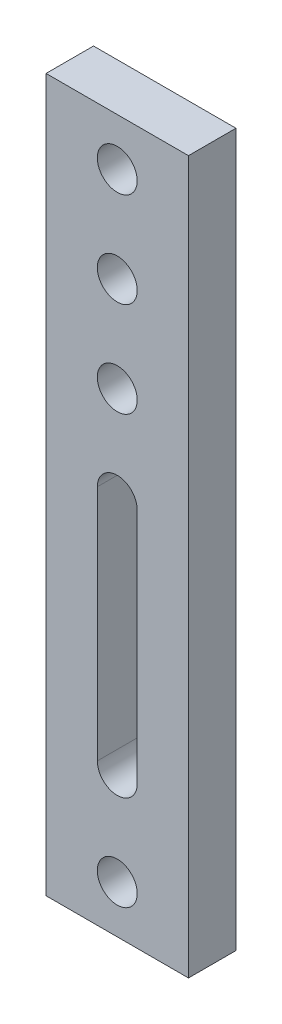
ISO-10303-21;
HEADER;
FILE_DESCRIPTION(('STEP AP214'),'2;1');
FILE_NAME('part.step','',(''),(''),'','','');
FILE_SCHEMA(('AUTOMOTIVE_DESIGN { 1 0 10303 214 1 1 1 1 }'));
ENDSEC;
DATA;
#1=APPLICATION_CONTEXT('core data for automotive mechanical design processes');
#2=APPLICATION_PROTOCOL_DEFINITION('international standard','automotive_design',2000,#1);
#3=PRODUCT_CONTEXT('',#1,'mechanical');
#4=PRODUCT('Part','Part','',(#3));
#5=PRODUCT_RELATED_PRODUCT_CATEGORY('part','',(#4));
#6=PRODUCT_DEFINITION_FORMATION('','',#4);
#7=PRODUCT_DEFINITION_CONTEXT('part definition',#1,'design');
#8=PRODUCT_DEFINITION('design','',#6,#7);
#9=PRODUCT_DEFINITION_SHAPE('','',#8);
#10=(LENGTH_UNIT() NAMED_UNIT(*) SI_UNIT(.MILLI.,.METRE.));
#11=(NAMED_UNIT(*) PLANE_ANGLE_UNIT() SI_UNIT($,.RADIAN.));
#12=(NAMED_UNIT(*) SI_UNIT($,.STERADIAN.) SOLID_ANGLE_UNIT());
#13=UNCERTAINTY_MEASURE_WITH_UNIT(LENGTH_MEASURE(1.E-05),#10,'distance_accuracy_value','');
#14=(GEOMETRIC_REPRESENTATION_CONTEXT(3) GLOBAL_UNCERTAINTY_ASSIGNED_CONTEXT((#13)) GLOBAL_UNIT_ASSIGNED_CONTEXT((#10,
#11,#12)) REPRESENTATION_CONTEXT('',''));
#15=CARTESIAN_POINT('',(0.,0.,0.));
#16=DIRECTION('',(0.,0.,1.));
#17=DIRECTION('',(1.,0.,0.));
#18=AXIS2_PLACEMENT_3D('',#15,#16,#17);
#19=CARTESIAN_POINT('',(0.,0.,25.));
#20=DIRECTION('',(1.,0.,0.));
#21=DIRECTION('',(0.,0.,-1.));
#22=AXIS2_PLACEMENT_3D('',#19,#20,#21);
#23=PLANE('',#22);
#24=DIRECTION('',(0.,-1.,0.));
#25=VECTOR('',#24,1.);
#26=CARTESIAN_POINT('',(0.,0.,0.));
#27=LINE('',#26,#25);
#28=CARTESIAN_POINT('',(0.,375.,0.));
#29=VERTEX_POINT('',#28);
#30=CARTESIAN_POINT('',(0.,0.,0.));
#31=VERTEX_POINT('',#30);
#32=EDGE_CURVE('E135',#29,#31,#27,.T.);
#33=ORIENTED_EDGE('',*,*,#32,.T.);
#34=DIRECTION('',(0.,0.,-1.));
#35=VECTOR('',#34,1.);
#36=CARTESIAN_POINT('',(0.,0.,25.));
#37=LINE('',#36,#35);
#38=CARTESIAN_POINT('',(0.,0.,25.));
#39=VERTEX_POINT('',#38);
#40=EDGE_CURVE('E11',#39,#31,#37,.T.);
#41=ORIENTED_EDGE('',*,*,#40,.F.);
#42=DIRECTION('',(0.,-1.,0.));
#43=VECTOR('',#42,1.);
#44=CARTESIAN_POINT('',(0.,0.,25.));
#45=LINE('',#44,#43);
#46=CARTESIAN_POINT('',(0.,375.,25.));
#47=VERTEX_POINT('',#46);
#48=EDGE_CURVE('E139',#47,#39,#45,.T.);
#49=ORIENTED_EDGE('',*,*,#48,.F.);
#50=DIRECTION('',(0.,0.,-1.));
#51=VECTOR('',#50,1.);
#52=CARTESIAN_POINT('',(0.,375.,25.));
#53=LINE('',#52,#51);
#54=EDGE_CURVE('E149',#47,#29,#53,.T.);
#55=ORIENTED_EDGE('',*,*,#54,.T.);
#56=EDGE_LOOP('',(#33,#41,#49,#55));
#57=FACE_BOUND('',#56,.T.);
#58=ADVANCED_FACE('F34',(#57),#23,.F.);
#59=CARTESIAN_POINT('',(0.,0.,25.));
#60=DIRECTION('',(0.,1.,0.));
#61=DIRECTION('',(0.,0.,1.));
#62=AXIS2_PLACEMENT_3D('',#59,#60,#61);
#63=PLANE('',#62);
#64=DIRECTION('',(1.,0.,0.));
#65=VECTOR('',#64,1.);
#66=CARTESIAN_POINT('',(0.,0.,0.));
#67=LINE('',#66,#65);
#68=CARTESIAN_POINT('',(75.,0.,0.));
#69=VERTEX_POINT('',#68);
#70=EDGE_CURVE('E152',#31,#69,#67,.T.);
#71=ORIENTED_EDGE('',*,*,#70,.T.);
#72=DIRECTION('',(0.,0.,-1.));
#73=VECTOR('',#72,1.);
#74=CARTESIAN_POINT('',(75.,0.,25.));
#75=LINE('',#74,#73);
#76=CARTESIAN_POINT('',(75.,0.,25.));
#77=VERTEX_POINT('',#76);
#78=EDGE_CURVE('E41',#77,#69,#75,.T.);
#79=ORIENTED_EDGE('',*,*,#78,.F.);
#80=DIRECTION('',(1.,0.,0.));
#81=VECTOR('',#80,1.);
#82=CARTESIAN_POINT('',(0.,0.,25.));
#83=LINE('',#82,#81);
#84=EDGE_CURVE('E142',#39,#77,#83,.T.);
#85=ORIENTED_EDGE('',*,*,#84,.F.);
#86=ORIENTED_EDGE('',*,*,#40,.T.);
#87=EDGE_LOOP('',(#71,#79,#85,#86));
#88=FACE_BOUND('',#87,.T.);
#89=ADVANCED_FACE('F180',(#88),#63,.F.);
#90=CARTESIAN_POINT('',(75.,0.,25.));
#91=DIRECTION('',(-1.,0.,0.));
#92=DIRECTION('',(0.,0.,1.));
#93=AXIS2_PLACEMENT_3D('',#90,#91,#92);
#94=PLANE('',#93);
#95=DIRECTION('',(0.,1.,0.));
#96=VECTOR('',#95,1.);
#97=CARTESIAN_POINT('',(75.,0.,0.));
#98=LINE('',#97,#96);
#99=CARTESIAN_POINT('',(75.,375.,0.));
#100=VERTEX_POINT('',#99);
#101=EDGE_CURVE('E154',#69,#100,#98,.T.);
#102=ORIENTED_EDGE('',*,*,#101,.T.);
#103=DIRECTION('',(0.,0.,-1.));
#104=VECTOR('',#103,1.);
#105=CARTESIAN_POINT('',(75.,375.,25.));
#106=LINE('',#105,#104);
#107=CARTESIAN_POINT('',(75.,375.,25.));
#108=VERTEX_POINT('',#107);
#109=EDGE_CURVE('E159',#108,#100,#106,.T.);
#110=ORIENTED_EDGE('',*,*,#109,.F.);
#111=DIRECTION('',(0.,1.,0.));
#112=VECTOR('',#111,1.);
#113=CARTESIAN_POINT('',(75.,0.,25.));
#114=LINE('',#113,#112);
#115=EDGE_CURVE('E145',#77,#108,#114,.T.);
#116=ORIENTED_EDGE('',*,*,#115,.F.);
#117=ORIENTED_EDGE('',*,*,#78,.T.);
#118=EDGE_LOOP('',(#102,#110,#116,#117));
#119=FACE_BOUND('',#118,.T.);
#120=ADVANCED_FACE('F166',(#119),#94,.F.);
#121=CARTESIAN_POINT('',(0.,375.,25.));
#122=DIRECTION('',(0.,-1.,0.));
#123=DIRECTION('',(0.,0.,-1.));
#124=AXIS2_PLACEMENT_3D('',#121,#122,#123);
#125=PLANE('',#124);
#126=DIRECTION('',(-1.,0.,0.));
#127=VECTOR('',#126,1.);
#128=CARTESIAN_POINT('',(0.,375.,0.));
#129=LINE('',#128,#127);
#130=EDGE_CURVE('E143',#100,#29,#129,.T.);
#131=ORIENTED_EDGE('',*,*,#130,.T.);
#132=ORIENTED_EDGE('',*,*,#54,.F.);
#133=DIRECTION('',(-1.,0.,0.));
#134=VECTOR('',#133,1.);
#135=CARTESIAN_POINT('',(0.,375.,25.));
#136=LINE('',#135,#134);
#137=EDGE_CURVE('E147',#108,#47,#136,.T.);
#138=ORIENTED_EDGE('',*,*,#137,.F.);
#139=ORIENTED_EDGE('',*,*,#109,.T.);
#140=EDGE_LOOP('',(#131,#132,#138,#139));
#141=FACE_BOUND('',#140,.T.);
#142=ADVANCED_FACE('F173',(#141),#125,.F.);
#143=CARTESIAN_POINT('',(0.,0.,25.));
#144=DIRECTION('',(0.,0.,-1.));
#145=DIRECTION('',(-1.,0.,0.));
#146=AXIS2_PLACEMENT_3D('',#143,#144,#145);
#147=PLANE('',#146);
#148=CARTESIAN_POINT('',(37.5,25.,25.));
#149=DIRECTION('',(0.,0.,1.));
#150=DIRECTION('',(1.,0.,0.));
#151=AXIS2_PLACEMENT_3D('',#148,#149,#150);
#152=CIRCLE('',#151,10.5);
#153=CARTESIAN_POINT('',(48.,25.,25.));
#154=VERTEX_POINT('',#153);
#155=EDGE_CURVE('E236',#154,#154,#152,.T.);
#156=ORIENTED_EDGE('',*,*,#155,.F.);
#157=EDGE_LOOP('',(#156));
#158=FACE_BOUND('',#157,.T.);
#159=CARTESIAN_POINT('',(37.4999999999997,350.,25.));
#160=DIRECTION('',(0.,0.,1.));
#161=DIRECTION('',(1.,0.,0.));
#162=AXIS2_PLACEMENT_3D('',#159,#160,#161);
#163=CIRCLE('',#162,10.5);
#164=CARTESIAN_POINT('',(47.9999999999997,350.,25.));
#165=VERTEX_POINT('',#164);
#166=EDGE_CURVE('E230',#165,#165,#163,.T.);
#167=ORIENTED_EDGE('',*,*,#166,.F.);
#168=EDGE_LOOP('',(#167));
#169=FACE_BOUND('',#168,.T.);
#170=CARTESIAN_POINT('',(37.4999999999998,300.,25.));
#171=DIRECTION('',(0.,0.,1.));
#172=DIRECTION('',(1.,0.,0.));
#173=AXIS2_PLACEMENT_3D('',#170,#171,#172);
#174=CIRCLE('',#173,10.5);
#175=CARTESIAN_POINT('',(47.9999999999998,300.,25.));
#176=VERTEX_POINT('',#175);
#177=EDGE_CURVE('E122',#176,#176,#174,.T.);
#178=ORIENTED_EDGE('',*,*,#177,.F.);
#179=EDGE_LOOP('',(#178));
#180=FACE_BOUND('',#179,.T.);
#181=CARTESIAN_POINT('',(37.5,250.,25.));
#182=DIRECTION('',(0.,0.,1.));
#183=DIRECTION('',(1.,0.,0.));
#184=AXIS2_PLACEMENT_3D('',#181,#182,#183);
#185=CIRCLE('',#184,10.5);
#186=CARTESIAN_POINT('',(48.,250.,25.));
#187=VERTEX_POINT('',#186);
#188=EDGE_CURVE('E243',#187,#187,#185,.T.);
#189=ORIENTED_EDGE('',*,*,#188,.F.);
#190=EDGE_LOOP('',(#189));
#191=FACE_BOUND('',#190,.T.);
#192=DIRECTION('',(0.,1.,0.));
#193=VECTOR('',#192,1.);
#194=CARTESIAN_POINT('',(48.,75.,25.));
#195=LINE('',#194,#193);
#196=CARTESIAN_POINT('',(48.,75.,25.));
#197=VERTEX_POINT('',#196);
#198=CARTESIAN_POINT('',(48.,200.,25.));
#199=VERTEX_POINT('',#198);
#200=EDGE_CURVE('E128',#197,#199,#195,.T.);
#201=ORIENTED_EDGE('',*,*,#200,.F.);
#202=CARTESIAN_POINT('',(37.5,75.,25.));
#203=DIRECTION('',(0.,0.,1.));
#204=DIRECTION('',(1.,0.,0.));
#205=AXIS2_PLACEMENT_3D('',#202,#203,#204);
#206=CIRCLE('',#205,10.5);
#207=CARTESIAN_POINT('',(27.,75.,25.));
#208=VERTEX_POINT('',#207);
#209=EDGE_CURVE('E48',#208,#197,#206,.T.);
#210=ORIENTED_EDGE('',*,*,#209,.F.);
#211=DIRECTION('',(0.,-1.,0.));
#212=VECTOR('',#211,1.);
#213=CARTESIAN_POINT('',(27.,75.,25.));
#214=LINE('',#213,#212);
#215=CARTESIAN_POINT('',(27.,200.,25.));
#216=VERTEX_POINT('',#215);
#217=EDGE_CURVE('E116',#216,#208,#214,.T.);
#218=ORIENTED_EDGE('',*,*,#217,.F.);
#219=CARTESIAN_POINT('',(37.5,200.,25.));
#220=DIRECTION('',(0.,0.,1.));
#221=DIRECTION('',(-1.,0.,0.));
#222=AXIS2_PLACEMENT_3D('',#219,#220,#221);
#223=CIRCLE('',#222,10.5);
#224=EDGE_CURVE('E119',#199,#216,#223,.T.);
#225=ORIENTED_EDGE('',*,*,#224,.F.);
#226=EDGE_LOOP('',(#201,#210,#218,#225));
#227=FACE_BOUND('',#226,.T.);
#228=ORIENTED_EDGE('',*,*,#48,.T.);
#229=ORIENTED_EDGE('',*,*,#84,.T.);
#230=ORIENTED_EDGE('',*,*,#115,.T.);
#231=ORIENTED_EDGE('',*,*,#137,.T.);
#232=EDGE_LOOP('',(#228,#229,#230,#231));
#233=FACE_BOUND('',#232,.T.);
#234=ADVANCED_FACE('F179',(#158,#169,#180,#191,#227,#233),#147,.F.);
#235=CARTESIAN_POINT('',(0.,0.,0.));
#236=DIRECTION('',(0.,0.,-1.));
#237=DIRECTION('',(-1.,0.,0.));
#238=AXIS2_PLACEMENT_3D('',#235,#236,#237);
#239=PLANE('',#238);
#240=CARTESIAN_POINT('',(37.5,25.,0.));
#241=DIRECTION('',(0.,0.,1.));
#242=DIRECTION('',(1.,0.,0.));
#243=AXIS2_PLACEMENT_3D('',#240,#241,#242);
#244=CIRCLE('',#243,10.5);
#245=CARTESIAN_POINT('',(48.,25.,0.));
#246=VERTEX_POINT('',#245);
#247=EDGE_CURVE('E232',#246,#246,#244,.T.);
#248=ORIENTED_EDGE('',*,*,#247,.T.);
#249=EDGE_LOOP('',(#248));
#250=FACE_BOUND('',#249,.T.);
#251=CARTESIAN_POINT('',(37.4999999999997,350.,0.));
#252=DIRECTION('',(0.,0.,1.));
#253=DIRECTION('',(1.,0.,0.));
#254=AXIS2_PLACEMENT_3D('',#251,#252,#253);
#255=CIRCLE('',#254,10.5);
#256=CARTESIAN_POINT('',(47.9999999999997,350.,0.));
#257=VERTEX_POINT('',#256);
#258=EDGE_CURVE('E227',#257,#257,#255,.T.);
#259=ORIENTED_EDGE('',*,*,#258,.T.);
#260=EDGE_LOOP('',(#259));
#261=FACE_BOUND('',#260,.T.);
#262=CARTESIAN_POINT('',(37.4999999999998,300.,0.));
#263=DIRECTION('',(0.,0.,1.));
#264=DIRECTION('',(1.,0.,0.));
#265=AXIS2_PLACEMENT_3D('',#262,#263,#264);
#266=CIRCLE('',#265,10.5);
#267=CARTESIAN_POINT('',(47.9999999999998,300.,0.));
#268=VERTEX_POINT('',#267);
#269=EDGE_CURVE('E245',#268,#268,#266,.T.);
#270=ORIENTED_EDGE('',*,*,#269,.T.);
#271=EDGE_LOOP('',(#270));
#272=FACE_BOUND('',#271,.T.);
#273=CARTESIAN_POINT('',(37.5,250.,0.));
#274=DIRECTION('',(0.,0.,1.));
#275=DIRECTION('',(1.,0.,0.));
#276=AXIS2_PLACEMENT_3D('',#273,#274,#275);
#277=CIRCLE('',#276,10.5);
#278=CARTESIAN_POINT('',(48.,250.,0.));
#279=VERTEX_POINT('',#278);
#280=EDGE_CURVE('E129',#279,#279,#277,.T.);
#281=ORIENTED_EDGE('',*,*,#280,.T.);
#282=EDGE_LOOP('',(#281));
#283=FACE_BOUND('',#282,.T.);
#284=CARTESIAN_POINT('',(37.5,75.,0.));
#285=DIRECTION('',(0.,0.,1.));
#286=DIRECTION('',(1.,0.,0.));
#287=AXIS2_PLACEMENT_3D('',#284,#285,#286);
#288=CIRCLE('',#287,10.5);
#289=CARTESIAN_POINT('',(27.,75.,0.));
#290=VERTEX_POINT('',#289);
#291=CARTESIAN_POINT('',(48.,75.,0.));
#292=VERTEX_POINT('',#291);
#293=EDGE_CURVE('E100',#290,#292,#288,.T.);
#294=ORIENTED_EDGE('',*,*,#293,.T.);
#295=DIRECTION('',(0.,1.,0.));
#296=VECTOR('',#295,1.);
#297=CARTESIAN_POINT('',(48.,75.,0.));
#298=LINE('',#297,#296);
#299=CARTESIAN_POINT('',(48.,200.,0.));
#300=VERTEX_POINT('',#299);
#301=EDGE_CURVE('E109',#292,#300,#298,.T.);
#302=ORIENTED_EDGE('',*,*,#301,.T.);
#303=CARTESIAN_POINT('',(37.5,200.,0.));
#304=DIRECTION('',(0.,0.,1.));
#305=DIRECTION('',(-1.,0.,0.));
#306=AXIS2_PLACEMENT_3D('',#303,#304,#305);
#307=CIRCLE('',#306,10.5);
#308=CARTESIAN_POINT('',(27.,200.,0.));
#309=VERTEX_POINT('',#308);
#310=EDGE_CURVE('E56',#300,#309,#307,.T.);
#311=ORIENTED_EDGE('',*,*,#310,.T.);
#312=DIRECTION('',(0.,-1.,0.));
#313=VECTOR('',#312,1.);
#314=CARTESIAN_POINT('',(27.,75.,0.));
#315=LINE('',#314,#313);
#316=EDGE_CURVE('E106',#309,#290,#315,.T.);
#317=ORIENTED_EDGE('',*,*,#316,.T.);
#318=EDGE_LOOP('',(#294,#302,#311,#317));
#319=FACE_BOUND('',#318,.T.);
#320=ORIENTED_EDGE('',*,*,#32,.F.);
#321=ORIENTED_EDGE('',*,*,#130,.F.);
#322=ORIENTED_EDGE('',*,*,#101,.F.);
#323=ORIENTED_EDGE('',*,*,#70,.F.);
#324=EDGE_LOOP('',(#320,#321,#322,#323));
#325=FACE_BOUND('',#324,.T.);
#326=ADVANCED_FACE('F113',(#250,#261,#272,#283,#319,#325),#239,.T.);
#327=CARTESIAN_POINT('',(37.5,75.,0.));
#328=DIRECTION('',(0.,0.,1.));
#329=DIRECTION('',(1.,0.,0.));
#330=AXIS2_PLACEMENT_3D('',#327,#328,#329);
#331=CYLINDRICAL_SURFACE('',#330,10.5);
#332=ORIENTED_EDGE('',*,*,#209,.T.);
#333=DIRECTION('',(0.,0.,1.));
#334=VECTOR('',#333,1.);
#335=CARTESIAN_POINT('',(48.,75.,0.));
#336=LINE('',#335,#334);
#337=EDGE_CURVE('E96',#292,#197,#336,.T.);
#338=ORIENTED_EDGE('',*,*,#337,.F.);
#339=ORIENTED_EDGE('',*,*,#293,.F.);
#340=DIRECTION('',(0.,0.,1.));
#341=VECTOR('',#340,1.);
#342=CARTESIAN_POINT('',(27.,75.,0.));
#343=LINE('',#342,#341);
#344=EDGE_CURVE('E133',#290,#208,#343,.T.);
#345=ORIENTED_EDGE('',*,*,#344,.T.);
#346=EDGE_LOOP('',(#332,#338,#339,#345));
#347=FACE_BOUND('',#346,.T.);
#348=ADVANCED_FACE('F98',(#347),#331,.F.);
#349=CARTESIAN_POINT('',(27.,75.,0.));
#350=DIRECTION('',(-1.,0.,0.));
#351=DIRECTION('',(0.,0.,1.));
#352=AXIS2_PLACEMENT_3D('',#349,#350,#351);
#353=PLANE('',#352);
#354=ORIENTED_EDGE('',*,*,#217,.T.);
#355=ORIENTED_EDGE('',*,*,#344,.F.);
#356=ORIENTED_EDGE('',*,*,#316,.F.);
#357=DIRECTION('',(0.,0.,1.));
#358=VECTOR('',#357,1.);
#359=CARTESIAN_POINT('',(27.,200.,0.));
#360=LINE('',#359,#358);
#361=EDGE_CURVE('E136',#309,#216,#360,.T.);
#362=ORIENTED_EDGE('',*,*,#361,.T.);
#363=EDGE_LOOP('',(#354,#355,#356,#362));
#364=FACE_BOUND('',#363,.T.);
#365=ADVANCED_FACE('F198',(#364),#353,.F.);
#366=CARTESIAN_POINT('',(37.5,200.,0.));
#367=DIRECTION('',(0.,0.,1.));
#368=DIRECTION('',(1.,0.,0.));
#369=AXIS2_PLACEMENT_3D('',#366,#367,#368);
#370=CYLINDRICAL_SURFACE('',#369,10.5);
#371=ORIENTED_EDGE('',*,*,#224,.T.);
#372=ORIENTED_EDGE('',*,*,#361,.F.);
#373=ORIENTED_EDGE('',*,*,#310,.F.);
#374=DIRECTION('',(0.,0.,1.));
#375=VECTOR('',#374,1.);
#376=CARTESIAN_POINT('',(48.,200.,0.));
#377=LINE('',#376,#375);
#378=EDGE_CURVE('E105',#300,#199,#377,.T.);
#379=ORIENTED_EDGE('',*,*,#378,.T.);
#380=EDGE_LOOP('',(#371,#372,#373,#379));
#381=FACE_BOUND('',#380,.T.);
#382=ADVANCED_FACE('F202',(#381),#370,.F.);
#383=CARTESIAN_POINT('',(48.,75.,0.));
#384=DIRECTION('',(1.,0.,0.));
#385=DIRECTION('',(0.,0.,-1.));
#386=AXIS2_PLACEMENT_3D('',#383,#384,#385);
#387=PLANE('',#386);
#388=ORIENTED_EDGE('',*,*,#200,.T.);
#389=ORIENTED_EDGE('',*,*,#378,.F.);
#390=ORIENTED_EDGE('',*,*,#301,.F.);
#391=ORIENTED_EDGE('',*,*,#337,.T.);
#392=EDGE_LOOP('',(#388,#389,#390,#391));
#393=FACE_BOUND('',#392,.T.);
#394=ADVANCED_FACE('F110',(#393),#387,.F.);
#395=CARTESIAN_POINT('',(37.5,250.,0.));
#396=DIRECTION('',(0.,0.,1.));
#397=DIRECTION('',(1.,0.,0.));
#398=AXIS2_PLACEMENT_3D('',#395,#396,#397);
#399=CYLINDRICAL_SURFACE('',#398,10.5);
#400=ORIENTED_EDGE('',*,*,#280,.F.);
#401=EDGE_LOOP('',(#400));
#402=FACE_BOUND('',#401,.T.);
#403=ORIENTED_EDGE('',*,*,#188,.T.);
#404=EDGE_LOOP('',(#403));
#405=FACE_BOUND('',#404,.T.);
#406=ADVANCED_FACE('F201',(#402,#405),#399,.F.);
#407=CARTESIAN_POINT('',(37.4999999999998,300.,0.));
#408=DIRECTION('',(0.,0.,1.));
#409=DIRECTION('',(1.,0.,0.));
#410=AXIS2_PLACEMENT_3D('',#407,#408,#409);
#411=CYLINDRICAL_SURFACE('',#410,10.5);
#412=ORIENTED_EDGE('',*,*,#269,.F.);
#413=EDGE_LOOP('',(#412));
#414=FACE_BOUND('',#413,.T.);
#415=ORIENTED_EDGE('',*,*,#177,.T.);
#416=EDGE_LOOP('',(#415));
#417=FACE_BOUND('',#416,.T.);
#418=ADVANCED_FACE('F208',(#414,#417),#411,.F.);
#419=CARTESIAN_POINT('',(37.4999999999997,350.,0.));
#420=DIRECTION('',(0.,0.,1.));
#421=DIRECTION('',(1.,0.,0.));
#422=AXIS2_PLACEMENT_3D('',#419,#420,#421);
#423=CYLINDRICAL_SURFACE('',#422,10.5);
#424=ORIENTED_EDGE('',*,*,#258,.F.);
#425=EDGE_LOOP('',(#424));
#426=FACE_BOUND('',#425,.T.);
#427=ORIENTED_EDGE('',*,*,#166,.T.);
#428=EDGE_LOOP('',(#427));
#429=FACE_BOUND('',#428,.T.);
#430=ADVANCED_FACE('F211',(#426,#429),#423,.F.);
#431=CARTESIAN_POINT('',(37.5,25.,0.));
#432=DIRECTION('',(0.,0.,1.));
#433=DIRECTION('',(1.,0.,0.));
#434=AXIS2_PLACEMENT_3D('',#431,#432,#433);
#435=CYLINDRICAL_SURFACE('',#434,10.5);
#436=ORIENTED_EDGE('',*,*,#247,.F.);
#437=EDGE_LOOP('',(#436));
#438=FACE_BOUND('',#437,.T.);
#439=ORIENTED_EDGE('',*,*,#155,.T.);
#440=EDGE_LOOP('',(#439));
#441=FACE_BOUND('',#440,.T.);
#442=ADVANCED_FACE('F216',(#438,#441),#435,.F.);
#443=CLOSED_SHELL('',(#58,#89,#120,#142,#234,#326,#348,#365,#382,#394,#406,#418,#430,#442));
#444=MANIFOLD_SOLID_BREP('B2',#443);
#445=ADVANCED_BREP_SHAPE_REPRESENTATION('',(#18,#444),#14);
#446=SHAPE_DEFINITION_REPRESENTATION(#9,#445);
ENDSEC;
END-ISO-10303-21;
